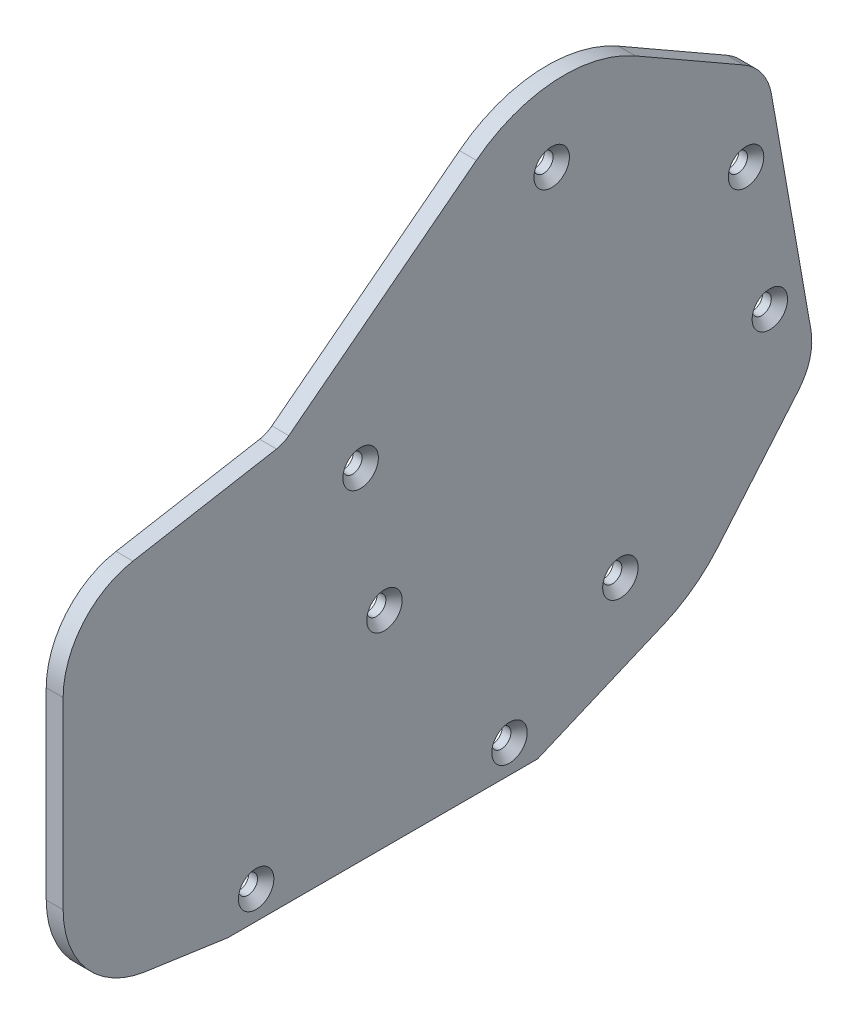
ISO-10303-21;
HEADER;
FILE_DESCRIPTION(('STEP AP214'),'2;1');
FILE_NAME('part.step','',(''),(''),'','','');
FILE_SCHEMA(('AUTOMOTIVE_DESIGN { 1 0 10303 214 1 1 1 1 }'));
ENDSEC;
DATA;
#1=APPLICATION_CONTEXT('core data for automotive mechanical design processes');
#2=APPLICATION_PROTOCOL_DEFINITION('international standard','automotive_design',2000,#1);
#3=PRODUCT_CONTEXT('',#1,'mechanical');
#4=PRODUCT('Part','Part','',(#3));
#5=PRODUCT_RELATED_PRODUCT_CATEGORY('part','',(#4));
#6=PRODUCT_DEFINITION_FORMATION('','',#4);
#7=PRODUCT_DEFINITION_CONTEXT('part definition',#1,'design');
#8=PRODUCT_DEFINITION('design','',#6,#7);
#9=PRODUCT_DEFINITION_SHAPE('','',#8);
#10=(LENGTH_UNIT() NAMED_UNIT(*) SI_UNIT(.MILLI.,.METRE.));
#11=(NAMED_UNIT(*) PLANE_ANGLE_UNIT() SI_UNIT($,.RADIAN.));
#12=(NAMED_UNIT(*) SI_UNIT($,.STERADIAN.) SOLID_ANGLE_UNIT());
#13=UNCERTAINTY_MEASURE_WITH_UNIT(LENGTH_MEASURE(1.E-05),#10,'distance_accuracy_value','');
#14=(GEOMETRIC_REPRESENTATION_CONTEXT(3) GLOBAL_UNCERTAINTY_ASSIGNED_CONTEXT((#13)) GLOBAL_UNIT_ASSIGNED_CONTEXT((#10,
#11,#12)) REPRESENTATION_CONTEXT('',''));
#15=CARTESIAN_POINT('',(0.,0.,0.));
#16=DIRECTION('',(0.,0.,1.));
#17=DIRECTION('',(1.,0.,0.));
#18=AXIS2_PLACEMENT_3D('',#15,#16,#17);
#19=CARTESIAN_POINT('',(32.,107.827207129074,19.0128458712949));
#20=DIRECTION('',(0.,-0.98480775301221,-0.173648177666922));
#21=DIRECTION('',(0.,0.173648177666922,-0.98480775301221));
#22=AXIS2_PLACEMENT_3D('',#19,#20,#21);
#23=PLANE('',#22);
#24=DIRECTION('',(0.,-0.173648177666922,0.98480775301221));
#25=VECTOR('',#24,1.);
#26=CARTESIAN_POINT('',(29.,107.827207129074,19.0128458712949));
#27=LINE('',#26,#25);
#28=CARTESIAN_POINT('',(29.,107.851102741169,18.8773271208524));
#29=VERTEX_POINT('',#28);
#30=CARTESIAN_POINT('',(29.,103.355324829032,44.3741506589923));
#31=VERTEX_POINT('',#30);
#32=EDGE_CURVE('E184',#29,#31,#27,.T.);
#33=ORIENTED_EDGE('',*,*,#32,.T.);
#34=DIRECTION('',(-1.,0.,0.));
#35=VECTOR('',#34,1.);
#36=CARTESIAN_POINT('',(32.,103.355324829032,44.3741506589923));
#37=LINE('',#36,#35);
#38=CARTESIAN_POINT('',(32.,103.355324829032,44.3741506589923));
#39=VERTEX_POINT('',#38);
#40=EDGE_CURVE('E11',#39,#31,#37,.T.);
#41=ORIENTED_EDGE('',*,*,#40,.F.);
#42=DIRECTION('',(0.,-0.173648177666922,0.98480775301221));
#43=VECTOR('',#42,1.);
#44=CARTESIAN_POINT('',(32.,107.827207129074,19.0128458712949));
#45=LINE('',#44,#43);
#46=CARTESIAN_POINT('',(32.,107.851102741169,18.8773271208524));
#47=VERTEX_POINT('',#46);
#48=EDGE_CURVE('E221',#47,#39,#45,.T.);
#49=ORIENTED_EDGE('',*,*,#48,.F.);
#50=DIRECTION('',(-1.,0.,0.));
#51=VECTOR('',#50,1.);
#52=CARTESIAN_POINT('',(32.,107.851102741169,18.8773271208524));
#53=LINE('',#52,#51);
#54=EDGE_CURVE('E180',#47,#29,#53,.T.);
#55=ORIENTED_EDGE('',*,*,#54,.T.);
#56=EDGE_LOOP('',(#33,#41,#49,#55));
#57=FACE_BOUND('',#56,.T.);
#58=ADVANCED_FACE('F41',(#57),#23,.F.);
#59=CARTESIAN_POINT('',(32.,88.5832085338493,41.7694279939884));
#60=DIRECTION('',(-1.,0.,0.));
#61=DIRECTION('',(0.,0.,1.));
#62=AXIS2_PLACEMENT_3D('',#59,#60,#61);
#63=CYLINDRICAL_SURFACE('',#62,15.);
#64=CARTESIAN_POINT('',(29.,88.5832085338493,41.7694279939884));
#65=DIRECTION('',(1.,0.,0.));
#66=DIRECTION('',(0.,0.,-1.));
#67=AXIS2_PLACEMENT_3D('',#64,#65,#66);
#68=CIRCLE('',#67,15.);
#69=CARTESIAN_POINT('',(29.,88.5832085338493,56.7694279939884));
#70=VERTEX_POINT('',#69);
#71=EDGE_CURVE('E187',#31,#70,#68,.T.);
#72=ORIENTED_EDGE('',*,*,#71,.T.);
#73=DIRECTION('',(-1.,0.,0.));
#74=VECTOR('',#73,1.);
#75=CARTESIAN_POINT('',(32.,88.5832085338493,56.7694279939884));
#76=LINE('',#75,#74);
#77=CARTESIAN_POINT('',(32.,88.5832085338493,56.7694279939884));
#78=VERTEX_POINT('',#77);
#79=EDGE_CURVE('E49',#78,#70,#76,.T.);
#80=ORIENTED_EDGE('',*,*,#79,.F.);
#81=CARTESIAN_POINT('',(32.,88.5832085338493,41.7694279939884));
#82=DIRECTION('',(1.,0.,0.));
#83=DIRECTION('',(0.,0.,-1.));
#84=AXIS2_PLACEMENT_3D('',#81,#82,#83);
#85=CIRCLE('',#84,15.);
#86=EDGE_CURVE('E120',#39,#78,#85,.T.);
#87=ORIENTED_EDGE('',*,*,#86,.F.);
#88=ORIENTED_EDGE('',*,*,#40,.T.);
#89=EDGE_LOOP('',(#72,#80,#87,#88));
#90=FACE_BOUND('',#89,.T.);
#91=ADVANCED_FACE('F315',(#90),#63,.T.);
#92=CARTESIAN_POINT('',(32.,0.,56.7694279939884));
#93=DIRECTION('',(0.,0.,-1.));
#94=DIRECTION('',(-1.,0.,0.));
#95=AXIS2_PLACEMENT_3D('',#92,#93,#94);
#96=PLANE('',#95);
#97=DIRECTION('',(0.,-1.,0.));
#98=VECTOR('',#97,1.);
#99=CARTESIAN_POINT('',(29.,0.,56.7694279939884));
#100=LINE('',#99,#98);
#101=CARTESIAN_POINT('',(29.,55.9344976089796,56.7694279939884));
#102=VERTEX_POINT('',#101);
#103=EDGE_CURVE('E190',#70,#102,#100,.T.);
#104=ORIENTED_EDGE('',*,*,#103,.T.);
#105=DIRECTION('',(-1.,0.,0.));
#106=VECTOR('',#105,1.);
#107=CARTESIAN_POINT('',(32.,55.9344976089796,56.7694279939884));
#108=LINE('',#107,#106);
#109=CARTESIAN_POINT('',(32.,55.9344976089796,56.7694279939884));
#110=VERTEX_POINT('',#109);
#111=EDGE_CURVE('E247',#110,#102,#108,.T.);
#112=ORIENTED_EDGE('',*,*,#111,.F.);
#113=DIRECTION('',(0.,-1.,0.));
#114=VECTOR('',#113,1.);
#115=CARTESIAN_POINT('',(32.,0.,56.7694279939884));
#116=LINE('',#115,#114);
#117=EDGE_CURVE('E255',#78,#110,#116,.T.);
#118=ORIENTED_EDGE('',*,*,#117,.F.);
#119=ORIENTED_EDGE('',*,*,#79,.T.);
#120=EDGE_LOOP('',(#104,#112,#118,#119));
#121=FACE_BOUND('',#120,.T.);
#122=ADVANCED_FACE('F253',(#121),#96,.F.);
#123=CARTESIAN_POINT('',(32.,55.9344976089796,39.7694279939874));
#124=DIRECTION('',(-1.,0.,0.));
#125=DIRECTION('',(0.,0.,1.));
#126=AXIS2_PLACEMENT_3D('',#123,#124,#125);
#127=CYLINDRICAL_SURFACE('',#126,17.000000000001);
#128=CARTESIAN_POINT('',(29.,55.9344976089796,39.7694279939874));
#129=DIRECTION('',(1.,0.,0.));
#130=DIRECTION('',(0.,0.,-1.));
#131=AXIS2_PLACEMENT_3D('',#128,#129,#130);
#132=CIRCLE('',#131,17.000000000001);
#133=CARTESIAN_POINT('',(29.,39.1068244967478,42.1838466875668));
#134=VERTEX_POINT('',#133);
#135=EDGE_CURVE('E192',#102,#134,#132,.T.);
#136=ORIENTED_EDGE('',*,*,#135,.T.);
#137=DIRECTION('',(-1.,0.,0.));
#138=VECTOR('',#137,1.);
#139=CARTESIAN_POINT('',(32.,39.1068244967478,42.1838466875668));
#140=LINE('',#139,#138);
#141=CARTESIAN_POINT('',(32.,39.1068244967478,42.1838466875668));
#142=VERTEX_POINT('',#141);
#143=EDGE_CURVE('E245',#142,#134,#140,.T.);
#144=ORIENTED_EDGE('',*,*,#143,.F.);
#145=CARTESIAN_POINT('',(32.,55.9344976089796,39.7694279939874));
#146=DIRECTION('',(1.,0.,0.));
#147=DIRECTION('',(0.,0.,-1.));
#148=AXIS2_PLACEMENT_3D('',#145,#146,#147);
#149=CIRCLE('',#148,17.000000000001);
#150=EDGE_CURVE('E267',#110,#142,#149,.T.);
#151=ORIENTED_EDGE('',*,*,#150,.F.);
#152=ORIENTED_EDGE('',*,*,#111,.T.);
#153=EDGE_LOOP('',(#136,#144,#151,#152));
#154=FACE_BOUND('',#153,.T.);
#155=ADVANCED_FACE('F264',(#154),#127,.T.);
#156=CARTESIAN_POINT('',(32.,32.3875872427274,-4.64694052215296));
#157=DIRECTION('',(0.,-0.98986312424887,0.142024629034072));
#158=DIRECTION('',(0.,-0.142024629034072,-0.98986312424887));
#159=AXIS2_PLACEMENT_3D('',#156,#157,#158);
#160=PLANE('',#159);
#161=DIRECTION('',(0.,0.142024629034072,0.98986312424887));
#162=VECTOR('',#161,1.);
#163=CARTESIAN_POINT('',(29.,32.3875872427274,-4.64694052215296));
#164=LINE('',#163,#162);
#165=CARTESIAN_POINT('',(29.,37.,27.5));
#166=VERTEX_POINT('',#165);
#167=EDGE_CURVE('E195',#166,#134,#164,.T.);
#168=ORIENTED_EDGE('',*,*,#167,.F.);
#169=DIRECTION('',(-1.,0.,0.));
#170=VECTOR('',#169,1.);
#171=CARTESIAN_POINT('',(32.,37.,27.5));
#172=LINE('',#171,#170);
#173=CARTESIAN_POINT('',(32.,37.,27.5));
#174=VERTEX_POINT('',#173);
#175=EDGE_CURVE('E243',#174,#166,#172,.T.);
#176=ORIENTED_EDGE('',*,*,#175,.F.);
#177=DIRECTION('',(0.,0.142024629034072,0.98986312424887));
#178=VECTOR('',#177,1.);
#179=CARTESIAN_POINT('',(32.,32.3875872427274,-4.64694052215296));
#180=LINE('',#179,#178);
#181=EDGE_CURVE('E269',#174,#142,#180,.T.);
#182=ORIENTED_EDGE('',*,*,#181,.T.);
#183=ORIENTED_EDGE('',*,*,#143,.T.);
#184=EDGE_LOOP('',(#168,#176,#182,#183));
#185=FACE_BOUND('',#184,.T.);
#186=ADVANCED_FACE('F326',(#185),#160,.T.);
#187=CARTESIAN_POINT('',(32.,37.,0.));
#188=DIRECTION('',(0.,1.,0.));
#189=DIRECTION('',(0.,0.,1.));
#190=AXIS2_PLACEMENT_3D('',#187,#188,#189);
#191=PLANE('',#190);
#192=DIRECTION('',(0.,0.,-1.));
#193=VECTOR('',#192,1.);
#194=CARTESIAN_POINT('',(29.,37.,0.));
#195=LINE('',#194,#193);
#196=CARTESIAN_POINT('',(29.,37.,-27.5));
#197=VERTEX_POINT('',#196);
#198=EDGE_CURVE('E198',#166,#197,#195,.T.);
#199=ORIENTED_EDGE('',*,*,#198,.T.);
#200=DIRECTION('',(-1.,0.,0.));
#201=VECTOR('',#200,1.);
#202=CARTESIAN_POINT('',(32.,37.,-27.5));
#203=LINE('',#202,#201);
#204=CARTESIAN_POINT('',(32.,37.,-27.5));
#205=VERTEX_POINT('',#204);
#206=EDGE_CURVE('E240',#205,#197,#203,.T.);
#207=ORIENTED_EDGE('',*,*,#206,.F.);
#208=DIRECTION('',(0.,0.,-1.));
#209=VECTOR('',#208,1.);
#210=CARTESIAN_POINT('',(32.,37.,0.));
#211=LINE('',#210,#209);
#212=EDGE_CURVE('E271',#174,#205,#211,.T.);
#213=ORIENTED_EDGE('',*,*,#212,.F.);
#214=ORIENTED_EDGE('',*,*,#175,.T.);
#215=EDGE_LOOP('',(#199,#207,#213,#214));
#216=FACE_BOUND('',#215,.T.);
#217=ADVANCED_FACE('F329',(#216),#191,.F.);
#218=CARTESIAN_POINT('',(32.,21.4742724506043,9.10751962461317));
#219=DIRECTION('',(0.,0.920624591801857,0.390448922356899));
#220=DIRECTION('',(0.,-0.390448922356899,0.920624591801857));
#221=AXIS2_PLACEMENT_3D('',#218,#219,#220);
#222=PLANE('',#221);
#223=DIRECTION('',(0.,0.390448922356899,-0.920624591801857));
#224=VECTOR('',#223,1.);
#225=CARTESIAN_POINT('',(29.,21.4742724506043,9.10751962461317));
#226=LINE('',#225,#224);
#227=CARTESIAN_POINT('',(29.,46.5240729090526,-49.956447520101));
#228=VERTEX_POINT('',#227);
#229=EDGE_CURVE('E200',#197,#228,#226,.T.);
#230=ORIENTED_EDGE('',*,*,#229,.T.);
#231=DIRECTION('',(-1.,0.,0.));
#232=VECTOR('',#231,1.);
#233=CARTESIAN_POINT('',(32.,46.5240729090526,-49.956447520101));
#234=LINE('',#233,#232);
#235=CARTESIAN_POINT('',(32.,46.5240729090526,-49.956447520101));
#236=VERTEX_POINT('',#235);
#237=EDGE_CURVE('E237',#236,#228,#234,.T.);
#238=ORIENTED_EDGE('',*,*,#237,.F.);
#239=DIRECTION('',(0.,0.390448922356899,-0.920624591801857));
#240=VECTOR('',#239,1.);
#241=CARTESIAN_POINT('',(32.,21.4742724506043,9.10751962461317));
#242=LINE('',#241,#240);
#243=EDGE_CURVE('E277',#205,#236,#242,.T.);
#244=ORIENTED_EDGE('',*,*,#243,.F.);
#245=ORIENTED_EDGE('',*,*,#206,.T.);
#246=EDGE_LOOP('',(#230,#238,#244,#245));
#247=FACE_BOUND('',#246,.T.);
#248=ADVANCED_FACE('F333',(#247),#222,.F.);
#249=CARTESIAN_POINT('',(32.,70.,-40.));
#250=DIRECTION('',(-1.,0.,0.));
#251=DIRECTION('',(0.,0.,1.));
#252=AXIS2_PLACEMENT_3D('',#249,#250,#251);
#253=CYLINDRICAL_SURFACE('',#252,25.5);
#254=CARTESIAN_POINT('',(29.,70.,-40.));
#255=DIRECTION('',(1.,0.,0.));
#256=DIRECTION('',(0.,0.,-1.));
#257=AXIS2_PLACEMENT_3D('',#254,#255,#256);
#258=CIRCLE('',#257,25.5);
#259=CARTESIAN_POINT('',(29.,53.5392235158278,-59.4754419086737));
#260=VERTEX_POINT('',#259);
#261=EDGE_CURVE('E202',#228,#260,#258,.T.);
#262=ORIENTED_EDGE('',*,*,#261,.T.);
#263=DIRECTION('',(-1.,0.,0.));
#264=VECTOR('',#263,1.);
#265=CARTESIAN_POINT('',(32.,53.5392235158278,-59.4754419086737));
#266=LINE('',#265,#264);
#267=CARTESIAN_POINT('',(32.,53.5392235158278,-59.4754419086737));
#268=VERTEX_POINT('',#267);
#269=EDGE_CURVE('E234',#268,#260,#266,.T.);
#270=ORIENTED_EDGE('',*,*,#269,.F.);
#271=CARTESIAN_POINT('',(32.,70.,-40.));
#272=DIRECTION('',(1.,0.,0.));
#273=DIRECTION('',(0.,0.,-1.));
#274=AXIS2_PLACEMENT_3D('',#271,#272,#273);
#275=CIRCLE('',#274,25.5);
#276=EDGE_CURVE('E279',#236,#268,#275,.T.);
#277=ORIENTED_EDGE('',*,*,#276,.F.);
#278=ORIENTED_EDGE('',*,*,#237,.T.);
#279=EDGE_LOOP('',(#262,#270,#277,#278));
#280=FACE_BOUND('',#279,.T.);
#281=ADVANCED_FACE('F337',(#280),#253,.T.);
#282=CARTESIAN_POINT('',(32.,-7.01246348953157,-8.29674259038667));
#283=DIRECTION('',(0.,0.645520646438126,0.763742819947987));
#284=DIRECTION('',(0.,-0.763742819947987,0.645520646438126));
#285=AXIS2_PLACEMENT_3D('',#282,#283,#284);
#286=PLANE('',#285);
#287=DIRECTION('',(0.,0.763742819947987,-0.645520646438126));
#288=VECTOR('',#287,1.);
#289=CARTESIAN_POINT('',(29.,-7.01246348953157,-8.29674259038667));
#290=LINE('',#289,#288);
#291=CARTESIAN_POINT('',(29.,70.5163970676817,-73.8246649188899));
#292=VERTEX_POINT('',#291);
#293=EDGE_CURVE('E204',#260,#292,#290,.T.);
#294=ORIENTED_EDGE('',*,*,#293,.T.);
#295=DIRECTION('',(-1.,0.,0.));
#296=VECTOR('',#295,1.);
#297=CARTESIAN_POINT('',(32.,70.5163970676817,-73.8246649188899));
#298=LINE('',#297,#296);
#299=CARTESIAN_POINT('',(32.,70.5163970676817,-73.8246649188899));
#300=VERTEX_POINT('',#299);
#301=EDGE_CURVE('E232',#300,#292,#298,.T.);
#302=ORIENTED_EDGE('',*,*,#301,.F.);
#303=DIRECTION('',(0.,0.763742819947987,-0.645520646438126));
#304=VECTOR('',#303,1.);
#305=CARTESIAN_POINT('',(32.,-7.01246348953157,-8.29674259038667));
#306=LINE('',#305,#304);
#307=EDGE_CURVE('E281',#268,#300,#306,.T.);
#308=ORIENTED_EDGE('',*,*,#307,.F.);
#309=ORIENTED_EDGE('',*,*,#269,.T.);
#310=EDGE_LOOP('',(#294,#302,#308,#309));
#311=FACE_BOUND('',#310,.T.);
#312=ADVANCED_FACE('F341',(#311),#286,.F.);
#313=CARTESIAN_POINT('',(32.,76.971603532063,-66.18723671941));
#314=DIRECTION('',(-1.,0.,0.));
#315=DIRECTION('',(0.,0.,1.));
#316=AXIS2_PLACEMENT_3D('',#313,#314,#315);
#317=CYLINDRICAL_SURFACE('',#316,10.);
#318=CARTESIAN_POINT('',(29.,76.971603532063,-66.18723671941));
#319=DIRECTION('',(1.,0.,0.));
#320=DIRECTION('',(0.,0.,-1.));
#321=AXIS2_PLACEMENT_3D('',#318,#319,#320);
#322=CIRCLE('',#321,10.);
#323=CARTESIAN_POINT('',(29.,78.7080853087322,-76.0353142495321));
#324=VERTEX_POINT('',#323);
#325=EDGE_CURVE('E207',#324,#292,#322,.F.);
#326=ORIENTED_EDGE('',*,*,#325,.F.);
#327=DIRECTION('',(-1.,0.,0.));
#328=VECTOR('',#327,1.);
#329=CARTESIAN_POINT('',(32.,78.7080853087322,-76.0353142495321));
#330=LINE('',#329,#328);
#331=CARTESIAN_POINT('',(32.,78.7080853087322,-76.0353142495321));
#332=VERTEX_POINT('',#331);
#333=EDGE_CURVE('E230',#332,#324,#330,.T.);
#334=ORIENTED_EDGE('',*,*,#333,.F.);
#335=CARTESIAN_POINT('',(32.,76.971603532063,-66.18723671941));
#336=DIRECTION('',(1.,0.,0.));
#337=DIRECTION('',(0.,0.,-1.));
#338=AXIS2_PLACEMENT_3D('',#335,#336,#337);
#339=CIRCLE('',#338,10.);
#340=EDGE_CURVE('E283',#332,#300,#339,.F.);
#341=ORIENTED_EDGE('',*,*,#340,.T.);
#342=ORIENTED_EDGE('',*,*,#301,.T.);
#343=EDGE_LOOP('',(#326,#334,#341,#342));
#344=FACE_BOUND('',#343,.T.);
#345=ADVANCED_FACE('F345',(#344),#317,.T.);
#346=CARTESIAN_POINT('',(32.,15.3761437126822,-87.2024442935679));
#347=DIRECTION('',(0.,0.173648177666922,-0.984807753012209));
#348=DIRECTION('',(0.,0.98480775301221,0.173648177666922));
#349=AXIS2_PLACEMENT_3D('',#346,#347,#348);
#350=PLANE('',#349);
#351=DIRECTION('',(0.,-0.98480775301221,-0.173648177666922));
#352=VECTOR('',#351,1.);
#353=CARTESIAN_POINT('',(29.,15.3761437126822,-87.2024442935679));
#354=LINE('',#353,#352);
#355=CARTESIAN_POINT('',(29.,118.45822872417,-69.0262914783599));
#356=VERTEX_POINT('',#355);
#357=EDGE_CURVE('E210',#356,#324,#354,.T.);
#358=ORIENTED_EDGE('',*,*,#357,.F.);
#359=DIRECTION('',(-1.,0.,0.));
#360=VECTOR('',#359,1.);
#361=CARTESIAN_POINT('',(32.,118.45822872417,-69.0262914783599));
#362=LINE('',#361,#360);
#363=CARTESIAN_POINT('',(32.,118.45822872417,-69.0262914783599));
#364=VERTEX_POINT('',#363);
#365=EDGE_CURVE('E228',#364,#356,#362,.T.);
#366=ORIENTED_EDGE('',*,*,#365,.F.);
#367=DIRECTION('',(0.,-0.98480775301221,-0.173648177666922));
#368=VECTOR('',#367,1.);
#369=CARTESIAN_POINT('',(32.,15.3761437126822,-87.2024442935679));
#370=LINE('',#369,#368);
#371=EDGE_CURVE('E286',#364,#332,#370,.T.);
#372=ORIENTED_EDGE('',*,*,#371,.T.);
#373=ORIENTED_EDGE('',*,*,#333,.T.);
#374=EDGE_LOOP('',(#358,#366,#372,#373));
#375=FACE_BOUND('',#374,.T.);
#376=ADVANCED_FACE('F349',(#375),#350,.T.);
#377=CARTESIAN_POINT('',(32.,116.7217469475,-59.1782139482378));
#378=DIRECTION('',(-1.,0.,0.));
#379=DIRECTION('',(0.,0.,1.));
#380=AXIS2_PLACEMENT_3D('',#377,#378,#379);
#381=CYLINDRICAL_SURFACE('',#380,9.99999999999999);
#382=CARTESIAN_POINT('',(29.,116.7217469475,-59.1782139482378));
#383=DIRECTION('',(1.,0.,0.));
#384=DIRECTION('',(0.,0.,-1.));
#385=AXIS2_PLACEMENT_3D('',#382,#383,#384);
#386=CIRCLE('',#385,9.99999999999999);
#387=CARTESIAN_POINT('',(29.,125.399811115155,-64.1472382289268));
#388=VERTEX_POINT('',#387);
#389=EDGE_CURVE('E213',#356,#388,#386,.T.);
#390=ORIENTED_EDGE('',*,*,#389,.T.);
#391=DIRECTION('',(-1.,0.,0.));
#392=VECTOR('',#391,1.);
#393=CARTESIAN_POINT('',(32.,125.399811115155,-64.1472382289268));
#394=LINE('',#393,#392);
#395=CARTESIAN_POINT('',(32.,125.399811115155,-64.1472382289268));
#396=VERTEX_POINT('',#395);
#397=EDGE_CURVE('E225',#396,#388,#394,.T.);
#398=ORIENTED_EDGE('',*,*,#397,.F.);
#399=CARTESIAN_POINT('',(32.,116.7217469475,-59.1782139482378));
#400=DIRECTION('',(1.,0.,0.));
#401=DIRECTION('',(0.,0.,-1.));
#402=AXIS2_PLACEMENT_3D('',#399,#400,#401);
#403=CIRCLE('',#402,9.99999999999999);
#404=EDGE_CURVE('E289',#364,#396,#403,.T.);
#405=ORIENTED_EDGE('',*,*,#404,.F.);
#406=ORIENTED_EDGE('',*,*,#365,.T.);
#407=EDGE_LOOP('',(#390,#398,#405,#406));
#408=FACE_BOUND('',#407,.T.);
#409=ADVANCED_FACE('F295',(#408),#381,.T.);
#410=CARTESIAN_POINT('',(32.,122.098348813603,-69.9130184065967));
#411=DIRECTION('',(0.,-0.867806416765414,0.496902428068903));
#412=DIRECTION('',(0.,-0.496902428068904,-0.867806416765415));
#413=AXIS2_PLACEMENT_3D('',#410,#411,#412);
#414=PLANE('',#413);
#415=DIRECTION('',(0.,0.496902428068904,0.867806416765415));
#416=VECTOR('',#415,1.);
#417=CARTESIAN_POINT('',(29.,122.098348813603,-69.9130184065967));
#418=LINE('',#417,#416);
#419=CARTESIAN_POINT('',(29.,136.445412513067,-44.8568439207455));
#420=VERTEX_POINT('',#419);
#421=EDGE_CURVE('E215',#388,#420,#418,.T.);
#422=ORIENTED_EDGE('',*,*,#421,.T.);
#423=DIRECTION('',(-1.,0.,0.));
#424=VECTOR('',#423,1.);
#425=CARTESIAN_POINT('',(32.,136.445412513067,-44.8568439207455));
#426=LINE('',#425,#424);
#427=CARTESIAN_POINT('',(32.,136.445412513067,-44.8568439207455));
#428=VERTEX_POINT('',#427);
#429=EDGE_CURVE('E176',#428,#420,#426,.T.);
#430=ORIENTED_EDGE('',*,*,#429,.F.);
#431=DIRECTION('',(0.,0.496902428068904,0.867806416765415));
#432=VECTOR('',#431,1.);
#433=CARTESIAN_POINT('',(32.,122.098348813603,-69.9130184065967));
#434=LINE('',#433,#432);
#435=EDGE_CURVE('E163',#396,#428,#434,.T.);
#436=ORIENTED_EDGE('',*,*,#435,.F.);
#437=ORIENTED_EDGE('',*,*,#397,.T.);
#438=EDGE_LOOP('',(#422,#430,#436,#437));
#439=FACE_BOUND('',#438,.T.);
#440=ADVANCED_FACE('F299',(#439),#414,.F.);
#441=CARTESIAN_POINT('',(32.,114.316348885549,-32.1858320049885));
#442=DIRECTION('',(-1.,0.,0.));
#443=DIRECTION('',(0.,0.,1.));
#444=AXIS2_PLACEMENT_3D('',#441,#442,#443);
#445=CYLINDRICAL_SURFACE('',#444,25.5);
#446=CARTESIAN_POINT('',(29.,114.316348885549,-32.1858320049885));
#447=DIRECTION('',(1.,0.,0.));
#448=DIRECTION('',(0.,0.,-1.));
#449=AXIS2_PLACEMENT_3D('',#446,#447,#448);
#450=CIRCLE('',#449,25.5);
#451=CARTESIAN_POINT('',(29.,134.506640074601,-16.6101412754802));
#452=VERTEX_POINT('',#451);
#453=EDGE_CURVE('E172',#420,#452,#450,.T.);
#454=ORIENTED_EDGE('',*,*,#453,.T.);
#455=DIRECTION('',(-1.,0.,0.));
#456=VECTOR('',#455,1.);
#457=CARTESIAN_POINT('',(32.,134.506640074601,-16.6101412754802));
#458=LINE('',#457,#456);
#459=CARTESIAN_POINT('',(32.,134.506640074601,-16.6101412754802));
#460=VERTEX_POINT('',#459);
#461=EDGE_CURVE('E169',#460,#452,#458,.T.);
#462=ORIENTED_EDGE('',*,*,#461,.F.);
#463=CARTESIAN_POINT('',(32.,114.316348885549,-32.1858320049885));
#464=DIRECTION('',(1.,0.,0.));
#465=DIRECTION('',(0.,0.,-1.));
#466=AXIS2_PLACEMENT_3D('',#463,#464,#465);
#467=CIRCLE('',#466,25.5);
#468=EDGE_CURVE('E157',#428,#460,#467,.T.);
#469=ORIENTED_EDGE('',*,*,#468,.F.);
#470=ORIENTED_EDGE('',*,*,#429,.T.);
#471=EDGE_LOOP('',(#454,#462,#469,#470));
#472=FACE_BOUND('',#471,.T.);
#473=ADVANCED_FACE('F170',(#472),#445,.T.);
#474=CARTESIAN_POINT('',(32.,76.2903870949506,58.8538057177573));
#475=DIRECTION('',(0.,0.791776125060864,0.610811401157185));
#476=DIRECTION('',(0.,-0.610811401157185,0.791776125060864));
#477=AXIS2_PLACEMENT_3D('',#474,#475,#476);
#478=PLANE('',#477);
#479=DIRECTION('',(0.,0.610811401157185,-0.791776125060864));
#480=VECTOR('',#479,1.);
#481=CARTESIAN_POINT('',(29.,76.2903870949506,58.8538057177573));
#482=LINE('',#481,#480);
#483=CARTESIAN_POINT('',(29.,108.816260880926,16.6915110034011));
#484=VERTEX_POINT('',#483);
#485=EDGE_CURVE('E218',#484,#452,#482,.T.);
#486=ORIENTED_EDGE('',*,*,#485,.F.);
#487=DIRECTION('',(-1.,0.,0.));
#488=VECTOR('',#487,1.);
#489=CARTESIAN_POINT('',(32.,108.816260880926,16.6915110034011));
#490=LINE('',#489,#488);
#491=CARTESIAN_POINT('',(32.,108.816260880926,16.6915110034011));
#492=VERTEX_POINT('',#491);
#493=EDGE_CURVE('E109',#492,#484,#490,.T.);
#494=ORIENTED_EDGE('',*,*,#493,.F.);
#495=DIRECTION('',(0.,0.610811401157185,-0.791776125060864));
#496=VECTOR('',#495,1.);
#497=CARTESIAN_POINT('',(32.,76.2903870949506,58.8538057177573));
#498=LINE('',#497,#496);
#499=EDGE_CURVE('E161',#492,#460,#498,.T.);
#500=ORIENTED_EDGE('',*,*,#499,.T.);
#501=ORIENTED_EDGE('',*,*,#461,.T.);
#502=EDGE_LOOP('',(#486,#494,#500,#501));
#503=FACE_BOUND('',#502,.T.);
#504=ADVANCED_FACE('F178',(#503),#478,.T.);
#505=CARTESIAN_POINT('',(32.,112.77514150623,19.745568009187));
#506=DIRECTION('',(-1.,0.,0.));
#507=DIRECTION('',(0.,0.,1.));
#508=AXIS2_PLACEMENT_3D('',#505,#506,#507);
#509=CYLINDRICAL_SURFACE('',#508,5.00000000000001);
#510=CARTESIAN_POINT('',(29.,112.77514150623,19.745568009187));
#511=DIRECTION('',(1.,0.,0.));
#512=DIRECTION('',(0.,0.,-1.));
#513=AXIS2_PLACEMENT_3D('',#510,#511,#512);
#514=CIRCLE('',#513,5.00000000000001);
#515=EDGE_CURVE('E112',#484,#29,#514,.F.);
#516=ORIENTED_EDGE('',*,*,#515,.T.);
#517=ORIENTED_EDGE('',*,*,#54,.F.);
#518=CARTESIAN_POINT('',(32.,112.77514150623,19.745568009187));
#519=DIRECTION('',(1.,0.,0.));
#520=DIRECTION('',(0.,0.,-1.));
#521=AXIS2_PLACEMENT_3D('',#518,#519,#520);
#522=CIRCLE('',#521,5.00000000000001);
#523=EDGE_CURVE('E57',#492,#47,#522,.F.);
#524=ORIENTED_EDGE('',*,*,#523,.F.);
#525=ORIENTED_EDGE('',*,*,#493,.T.);
#526=EDGE_LOOP('',(#516,#517,#524,#525));
#527=FACE_BOUND('',#526,.T.);
#528=ADVANCED_FACE('F303',(#527),#509,.F.);
#529=CARTESIAN_POINT('',(32.,0.,0.));
#530=DIRECTION('',(1.,0.,0.));
#531=DIRECTION('',(0.,0.,-1.));
#532=AXIS2_PLACEMENT_3D('',#529,#530,#531);
#533=PLANE('',#532);
#534=CARTESIAN_POINT('',(32.,109.53787763407,-64.506630381622));
#535=DIRECTION('',(1.,0.,0.));
#536=DIRECTION('',(0.,0.,-1.));
#537=AXIS2_PLACEMENT_3D('',#534,#535,#536);
#538=CIRCLE('',#537,3.15);
#539=CARTESIAN_POINT('',(32.,109.53787763407,-67.6566303816221));
#540=VERTEX_POINT('',#539);
#541=EDGE_CURVE('E697',#540,#540,#538,.T.);
#542=ORIENTED_EDGE('',*,*,#541,.F.);
#543=EDGE_LOOP('',(#542));
#544=FACE_BOUND('',#543,.T.);
#545=CARTESIAN_POINT('',(32.,85.5446582668281,-68.7372823101235));
#546=DIRECTION('',(1.,0.,0.));
#547=DIRECTION('',(0.,0.,-1.));
#548=AXIS2_PLACEMENT_3D('',#545,#546,#547);
#549=CIRCLE('',#548,3.15);
#550=CARTESIAN_POINT('',(32.,85.5446582668281,-71.8872823101235));
#551=VERTEX_POINT('',#550);
#552=EDGE_CURVE('E704',#551,#551,#549,.T.);
#553=ORIENTED_EDGE('',*,*,#552,.F.);
#554=EDGE_LOOP('',(#553));
#555=FACE_BOUND('',#554,.T.);
#556=CARTESIAN_POINT('',(32.,97.469329286219,3.93750845272652));
#557=DIRECTION('',(1.,0.,0.));
#558=DIRECTION('',(0.,0.,-1.));
#559=AXIS2_PLACEMENT_3D('',#556,#557,#558);
#560=CIRCLE('',#559,3.15);
#561=CARTESIAN_POINT('',(32.,97.469329286219,0.787508452726517));
#562=VERTEX_POINT('',#561);
#563=EDGE_CURVE('E713',#562,#562,#560,.T.);
#564=ORIENTED_EDGE('',*,*,#563,.F.);
#565=EDGE_LOOP('',(#564));
#566=FACE_BOUND('',#565,.T.);
#567=CARTESIAN_POINT('',(32.,73.476109918977,-0.293143475774924));
#568=DIRECTION('',(1.,0.,0.));
#569=DIRECTION('',(0.,0.,-1.));
#570=AXIS2_PLACEMENT_3D('',#567,#568,#569);
#571=CIRCLE('',#570,3.15);
#572=CARTESIAN_POINT('',(32.,73.476109918977,-3.44314347577492));
#573=VERTEX_POINT('',#572);
#574=EDGE_CURVE('E722',#573,#573,#571,.T.);
#575=ORIENTED_EDGE('',*,*,#574,.F.);
#576=EDGE_LOOP('',(#575));
#577=FACE_BOUND('',#576,.T.);
#578=CARTESIAN_POINT('',(32.,57.5421819243955,-42.1966494474866));
#579=DIRECTION('',(1.,0.,0.));
#580=DIRECTION('',(0.,0.,-1.));
#581=AXIS2_PLACEMENT_3D('',#578,#579,#580);
#582=CIRCLE('',#581,3.15);
#583=CARTESIAN_POINT('',(32.,57.5421819243955,-45.3466494474866));
#584=VERTEX_POINT('',#583);
#585=EDGE_CURVE('E731',#584,#584,#582,.T.);
#586=ORIENTED_EDGE('',*,*,#585,.F.);
#587=EDGE_LOOP('',(#586));
#588=FACE_BOUND('',#587,.T.);
#589=CARTESIAN_POINT('',(32.,126.774166961154,-29.9891825575019));
#590=DIRECTION('',(1.,0.,0.));
#591=DIRECTION('',(0.,0.,-1.));
#592=AXIS2_PLACEMENT_3D('',#589,#590,#591);
#593=CIRCLE('',#592,3.14999999999999);
#594=CARTESIAN_POINT('',(32.,126.774166961154,-33.1391825575019));
#595=VERTEX_POINT('',#594);
#596=EDGE_CURVE('E740',#595,#595,#593,.T.);
#597=ORIENTED_EDGE('',*,*,#596,.F.);
#598=EDGE_LOOP('',(#597));
#599=FACE_BOUND('',#598,.T.);
#600=CARTESIAN_POINT('',(32.,42.,22.5));
#601=DIRECTION('',(1.,0.,0.));
#602=DIRECTION('',(0.,0.,-1.));
#603=AXIS2_PLACEMENT_3D('',#600,#601,#602);
#604=CIRCLE('',#603,3.15);
#605=CARTESIAN_POINT('',(32.,42.,19.35));
#606=VERTEX_POINT('',#605);
#607=EDGE_CURVE('E749',#606,#606,#604,.T.);
#608=ORIENTED_EDGE('',*,*,#607,.F.);
#609=EDGE_LOOP('',(#608));
#610=FACE_BOUND('',#609,.T.);
#611=CARTESIAN_POINT('',(32.,42.,-22.5));
#612=DIRECTION('',(1.,0.,0.));
#613=DIRECTION('',(0.,0.,-1.));
#614=AXIS2_PLACEMENT_3D('',#611,#612,#613);
#615=CIRCLE('',#614,3.15);
#616=CARTESIAN_POINT('',(32.,42.,-25.65));
#617=VERTEX_POINT('',#616);
#618=EDGE_CURVE('E758',#617,#617,#615,.T.);
#619=ORIENTED_EDGE('',*,*,#618,.F.);
#620=EDGE_LOOP('',(#619));
#621=FACE_BOUND('',#620,.T.);
#622=ORIENTED_EDGE('',*,*,#48,.T.);
#623=ORIENTED_EDGE('',*,*,#86,.T.);
#624=ORIENTED_EDGE('',*,*,#117,.T.);
#625=ORIENTED_EDGE('',*,*,#150,.T.);
#626=ORIENTED_EDGE('',*,*,#181,.F.);
#627=ORIENTED_EDGE('',*,*,#212,.T.);
#628=ORIENTED_EDGE('',*,*,#243,.T.);
#629=ORIENTED_EDGE('',*,*,#276,.T.);
#630=ORIENTED_EDGE('',*,*,#307,.T.);
#631=ORIENTED_EDGE('',*,*,#340,.F.);
#632=ORIENTED_EDGE('',*,*,#371,.F.);
#633=ORIENTED_EDGE('',*,*,#404,.T.);
#634=ORIENTED_EDGE('',*,*,#435,.T.);
#635=ORIENTED_EDGE('',*,*,#468,.T.);
#636=ORIENTED_EDGE('',*,*,#499,.F.);
#637=ORIENTED_EDGE('',*,*,#523,.T.);
#638=EDGE_LOOP('',(#622,#623,#624,#625,#626,#627,#628,#629,#630,#631,#632,#633,#634,#635,#636,#637));
#639=FACE_BOUND('',#638,.T.);
#640=ADVANCED_FACE('F159',(#544,#555,#566,#577,#588,#599,#610,#621,#639),#533,.T.);
#641=CARTESIAN_POINT('',(29.,0.,0.));
#642=DIRECTION('',(1.,0.,0.));
#643=DIRECTION('',(0.,0.,-1.));
#644=AXIS2_PLACEMENT_3D('',#641,#642,#643);
#645=PLANE('',#644);
#646=CARTESIAN_POINT('',(29.,109.53787763407,-64.506630381622));
#647=DIRECTION('',(1.,0.,0.));
#648=DIRECTION('',(0.,0.,-1.));
#649=AXIS2_PLACEMENT_3D('',#646,#647,#648);
#650=CIRCLE('',#649,1.69999999999999);
#651=CARTESIAN_POINT('',(29.,109.53787763407,-66.206630381622));
#652=VERTEX_POINT('',#651);
#653=EDGE_CURVE('E699',#652,#652,#650,.T.);
#654=ORIENTED_EDGE('',*,*,#653,.T.);
#655=EDGE_LOOP('',(#654));
#656=FACE_BOUND('',#655,.T.);
#657=CARTESIAN_POINT('',(29.,85.5446582668281,-68.7372823101235));
#658=DIRECTION('',(1.,0.,0.));
#659=DIRECTION('',(0.,0.,-1.));
#660=AXIS2_PLACEMENT_3D('',#657,#658,#659);
#661=CIRCLE('',#660,1.69999999999999);
#662=CARTESIAN_POINT('',(29.,85.5446582668281,-70.4372823101235));
#663=VERTEX_POINT('',#662);
#664=EDGE_CURVE('E710',#663,#663,#661,.T.);
#665=ORIENTED_EDGE('',*,*,#664,.T.);
#666=EDGE_LOOP('',(#665));
#667=FACE_BOUND('',#666,.T.);
#668=CARTESIAN_POINT('',(29.,97.469329286219,3.93750845272652));
#669=DIRECTION('',(1.,0.,0.));
#670=DIRECTION('',(0.,0.,-1.));
#671=AXIS2_PLACEMENT_3D('',#668,#669,#670);
#672=CIRCLE('',#671,1.69999999999999);
#673=CARTESIAN_POINT('',(29.,97.469329286219,2.23750845272652));
#674=VERTEX_POINT('',#673);
#675=EDGE_CURVE('E719',#674,#674,#672,.T.);
#676=ORIENTED_EDGE('',*,*,#675,.T.);
#677=EDGE_LOOP('',(#676));
#678=FACE_BOUND('',#677,.T.);
#679=CARTESIAN_POINT('',(29.,73.476109918977,-0.293143475774924));
#680=DIRECTION('',(1.,0.,0.));
#681=DIRECTION('',(0.,0.,-1.));
#682=AXIS2_PLACEMENT_3D('',#679,#680,#681);
#683=CIRCLE('',#682,1.69999999999999);
#684=CARTESIAN_POINT('',(29.,73.476109918977,-1.99314347577492));
#685=VERTEX_POINT('',#684);
#686=EDGE_CURVE('E728',#685,#685,#683,.T.);
#687=ORIENTED_EDGE('',*,*,#686,.T.);
#688=EDGE_LOOP('',(#687));
#689=FACE_BOUND('',#688,.T.);
#690=CARTESIAN_POINT('',(29.,57.5421819243955,-42.1966494474866));
#691=DIRECTION('',(1.,0.,0.));
#692=DIRECTION('',(0.,0.,-1.));
#693=AXIS2_PLACEMENT_3D('',#690,#691,#692);
#694=CIRCLE('',#693,1.69999999999999);
#695=CARTESIAN_POINT('',(29.,57.5421819243955,-43.8966494474866));
#696=VERTEX_POINT('',#695);
#697=EDGE_CURVE('E737',#696,#696,#694,.T.);
#698=ORIENTED_EDGE('',*,*,#697,.T.);
#699=EDGE_LOOP('',(#698));
#700=FACE_BOUND('',#699,.T.);
#701=CARTESIAN_POINT('',(29.,126.774166961154,-29.9891825575019));
#702=DIRECTION('',(1.,0.,0.));
#703=DIRECTION('',(0.,0.,-1.));
#704=AXIS2_PLACEMENT_3D('',#701,#702,#703);
#705=CIRCLE('',#704,1.69999999999998);
#706=CARTESIAN_POINT('',(29.,126.774166961154,-31.6891825575019));
#707=VERTEX_POINT('',#706);
#708=EDGE_CURVE('E746',#707,#707,#705,.T.);
#709=ORIENTED_EDGE('',*,*,#708,.T.);
#710=EDGE_LOOP('',(#709));
#711=FACE_BOUND('',#710,.T.);
#712=CARTESIAN_POINT('',(29.,42.,22.5));
#713=DIRECTION('',(1.,0.,0.));
#714=DIRECTION('',(0.,0.,-1.));
#715=AXIS2_PLACEMENT_3D('',#712,#713,#714);
#716=CIRCLE('',#715,1.69999999999999);
#717=CARTESIAN_POINT('',(29.,42.,20.8));
#718=VERTEX_POINT('',#717);
#719=EDGE_CURVE('E755',#718,#718,#716,.T.);
#720=ORIENTED_EDGE('',*,*,#719,.T.);
#721=EDGE_LOOP('',(#720));
#722=FACE_BOUND('',#721,.T.);
#723=CARTESIAN_POINT('',(29.,42.,-22.5));
#724=DIRECTION('',(1.,0.,0.));
#725=DIRECTION('',(0.,0.,-1.));
#726=AXIS2_PLACEMENT_3D('',#723,#724,#725);
#727=CIRCLE('',#726,1.69999999999999);
#728=CARTESIAN_POINT('',(29.,42.,-24.2));
#729=VERTEX_POINT('',#728);
#730=EDGE_CURVE('E188',#729,#729,#727,.T.);
#731=ORIENTED_EDGE('',*,*,#730,.T.);
#732=EDGE_LOOP('',(#731));
#733=FACE_BOUND('',#732,.T.);
#734=ORIENTED_EDGE('',*,*,#32,.F.);
#735=ORIENTED_EDGE('',*,*,#515,.F.);
#736=ORIENTED_EDGE('',*,*,#485,.T.);
#737=ORIENTED_EDGE('',*,*,#453,.F.);
#738=ORIENTED_EDGE('',*,*,#421,.F.);
#739=ORIENTED_EDGE('',*,*,#389,.F.);
#740=ORIENTED_EDGE('',*,*,#357,.T.);
#741=ORIENTED_EDGE('',*,*,#325,.T.);
#742=ORIENTED_EDGE('',*,*,#293,.F.);
#743=ORIENTED_EDGE('',*,*,#261,.F.);
#744=ORIENTED_EDGE('',*,*,#229,.F.);
#745=ORIENTED_EDGE('',*,*,#198,.F.);
#746=ORIENTED_EDGE('',*,*,#167,.T.);
#747=ORIENTED_EDGE('',*,*,#135,.F.);
#748=ORIENTED_EDGE('',*,*,#103,.F.);
#749=ORIENTED_EDGE('',*,*,#71,.F.);
#750=EDGE_LOOP('',(#734,#735,#736,#737,#738,#739,#740,#741,#742,#743,#744,#745,#746,#747,#748,#749));
#751=FACE_BOUND('',#750,.T.);
#752=ADVANCED_FACE('F259',(#656,#667,#678,#689,#700,#711,#722,#733,#751),#645,.F.);
#753=CARTESIAN_POINT('',(32.,42.,-22.5));
#754=DIRECTION('',(1.,0.,0.));
#755=DIRECTION('',(0.,0.,-1.));
#756=AXIS2_PLACEMENT_3D('',#753,#754,#755);
#757=CYLINDRICAL_SURFACE('',#756,1.69999999999999);
#758=ORIENTED_EDGE('',*,*,#730,.F.);
#759=EDGE_LOOP('',(#758));
#760=FACE_BOUND('',#759,.T.);
#761=CARTESIAN_POINT('',(30.55,42.,-22.5));
#762=DIRECTION('',(1.,0.,0.));
#763=DIRECTION('',(0.,0.,-1.));
#764=AXIS2_PLACEMENT_3D('',#761,#762,#763);
#765=CIRCLE('',#764,1.7);
#766=CARTESIAN_POINT('',(30.55,42.,-24.2));
#767=VERTEX_POINT('',#766);
#768=EDGE_CURVE('E761',#767,#767,#765,.T.);
#769=ORIENTED_EDGE('',*,*,#768,.T.);
#770=EDGE_LOOP('',(#769));
#771=FACE_BOUND('',#770,.T.);
#772=ADVANCED_FACE('F389',(#760,#771),#757,.F.);
#773=CARTESIAN_POINT('',(32.,42.,-22.5));
#774=DIRECTION('',(1.,0.,0.));
#775=DIRECTION('',(0.,0.,-1.));
#776=AXIS2_PLACEMENT_3D('',#773,#774,#775);
#777=CONICAL_SURFACE('',#776,3.15,0.785398163397448);
#778=ORIENTED_EDGE('',*,*,#768,.F.);
#779=EDGE_LOOP('',(#778));
#780=FACE_BOUND('',#779,.T.);
#781=ORIENTED_EDGE('',*,*,#618,.T.);
#782=EDGE_LOOP('',(#781));
#783=FACE_BOUND('',#782,.T.);
#784=ADVANCED_FACE('F399',(#780,#783),#777,.F.);
#785=CARTESIAN_POINT('',(32.,42.,22.5));
#786=DIRECTION('',(1.,0.,0.));
#787=DIRECTION('',(0.,0.,-1.));
#788=AXIS2_PLACEMENT_3D('',#785,#786,#787);
#789=CYLINDRICAL_SURFACE('',#788,1.69999999999999);
#790=ORIENTED_EDGE('',*,*,#719,.F.);
#791=EDGE_LOOP('',(#790));
#792=FACE_BOUND('',#791,.T.);
#793=CARTESIAN_POINT('',(30.55,42.,22.5));
#794=DIRECTION('',(1.,0.,0.));
#795=DIRECTION('',(0.,0.,-1.));
#796=AXIS2_PLACEMENT_3D('',#793,#794,#795);
#797=CIRCLE('',#796,1.7);
#798=CARTESIAN_POINT('',(30.55,42.,20.8));
#799=VERTEX_POINT('',#798);
#800=EDGE_CURVE('E752',#799,#799,#797,.T.);
#801=ORIENTED_EDGE('',*,*,#800,.T.);
#802=EDGE_LOOP('',(#801));
#803=FACE_BOUND('',#802,.T.);
#804=ADVANCED_FACE('F410',(#792,#803),#789,.F.);
#805=CARTESIAN_POINT('',(32.,42.,22.5));
#806=DIRECTION('',(1.,0.,0.));
#807=DIRECTION('',(0.,0.,-1.));
#808=AXIS2_PLACEMENT_3D('',#805,#806,#807);
#809=CONICAL_SURFACE('',#808,3.15,0.785398163397448);
#810=ORIENTED_EDGE('',*,*,#800,.F.);
#811=EDGE_LOOP('',(#810));
#812=FACE_BOUND('',#811,.T.);
#813=ORIENTED_EDGE('',*,*,#607,.T.);
#814=EDGE_LOOP('',(#813));
#815=FACE_BOUND('',#814,.T.);
#816=ADVANCED_FACE('F421',(#812,#815),#809,.F.);
#817=CARTESIAN_POINT('',(32.,126.774166961154,-29.9891825575019));
#818=DIRECTION('',(1.,0.,0.));
#819=DIRECTION('',(0.,0.,-1.));
#820=AXIS2_PLACEMENT_3D('',#817,#818,#819);
#821=CYLINDRICAL_SURFACE('',#820,1.69999999999999);
#822=ORIENTED_EDGE('',*,*,#708,.F.);
#823=EDGE_LOOP('',(#822));
#824=FACE_BOUND('',#823,.T.);
#825=CARTESIAN_POINT('',(30.55,126.774166961154,-29.9891825575019));
#826=DIRECTION('',(1.,0.,0.));
#827=DIRECTION('',(0.,0.,-1.));
#828=AXIS2_PLACEMENT_3D('',#825,#826,#827);
#829=CIRCLE('',#828,1.70000000000001);
#830=CARTESIAN_POINT('',(30.55,126.774166961154,-31.6891825575019));
#831=VERTEX_POINT('',#830);
#832=EDGE_CURVE('E743',#831,#831,#829,.T.);
#833=ORIENTED_EDGE('',*,*,#832,.T.);
#834=EDGE_LOOP('',(#833));
#835=FACE_BOUND('',#834,.T.);
#836=ADVANCED_FACE('F432',(#824,#835),#821,.F.);
#837=CARTESIAN_POINT('',(32.,126.774166961154,-29.9891825575019));
#838=DIRECTION('',(1.,0.,0.));
#839=DIRECTION('',(0.,0.,-1.));
#840=AXIS2_PLACEMENT_3D('',#837,#838,#839);
#841=CONICAL_SURFACE('',#840,3.14999999999999,0.785398163397441);
#842=ORIENTED_EDGE('',*,*,#832,.F.);
#843=EDGE_LOOP('',(#842));
#844=FACE_BOUND('',#843,.T.);
#845=ORIENTED_EDGE('',*,*,#596,.T.);
#846=EDGE_LOOP('',(#845));
#847=FACE_BOUND('',#846,.T.);
#848=ADVANCED_FACE('F443',(#844,#847),#841,.F.);
#849=CARTESIAN_POINT('',(32.,57.5421819243955,-42.1966494474866));
#850=DIRECTION('',(1.,0.,0.));
#851=DIRECTION('',(0.,0.,-1.));
#852=AXIS2_PLACEMENT_3D('',#849,#850,#851);
#853=CYLINDRICAL_SURFACE('',#852,1.69999999999999);
#854=ORIENTED_EDGE('',*,*,#697,.F.);
#855=EDGE_LOOP('',(#854));
#856=FACE_BOUND('',#855,.T.);
#857=CARTESIAN_POINT('',(30.55,57.5421819243955,-42.1966494474866));
#858=DIRECTION('',(1.,0.,0.));
#859=DIRECTION('',(0.,0.,-1.));
#860=AXIS2_PLACEMENT_3D('',#857,#858,#859);
#861=CIRCLE('',#860,1.7);
#862=CARTESIAN_POINT('',(30.55,57.5421819243955,-43.8966494474866));
#863=VERTEX_POINT('',#862);
#864=EDGE_CURVE('E734',#863,#863,#861,.T.);
#865=ORIENTED_EDGE('',*,*,#864,.T.);
#866=EDGE_LOOP('',(#865));
#867=FACE_BOUND('',#866,.T.);
#868=ADVANCED_FACE('F454',(#856,#867),#853,.F.);
#869=CARTESIAN_POINT('',(32.,57.5421819243955,-42.1966494474866));
#870=DIRECTION('',(1.,0.,0.));
#871=DIRECTION('',(0.,0.,-1.));
#872=AXIS2_PLACEMENT_3D('',#869,#870,#871);
#873=CONICAL_SURFACE('',#872,3.15,0.785398163397448);
#874=ORIENTED_EDGE('',*,*,#864,.F.);
#875=EDGE_LOOP('',(#874));
#876=FACE_BOUND('',#875,.T.);
#877=ORIENTED_EDGE('',*,*,#585,.T.);
#878=EDGE_LOOP('',(#877));
#879=FACE_BOUND('',#878,.T.);
#880=ADVANCED_FACE('F465',(#876,#879),#873,.F.);
#881=CARTESIAN_POINT('',(32.,73.476109918977,-0.293143475774924));
#882=DIRECTION('',(1.,0.,0.));
#883=DIRECTION('',(0.,0.,-1.));
#884=AXIS2_PLACEMENT_3D('',#881,#882,#883);
#885=CYLINDRICAL_SURFACE('',#884,1.69999999999999);
#886=ORIENTED_EDGE('',*,*,#686,.F.);
#887=EDGE_LOOP('',(#886));
#888=FACE_BOUND('',#887,.T.);
#889=CARTESIAN_POINT('',(30.55,73.476109918977,-0.293143475774924));
#890=DIRECTION('',(1.,0.,0.));
#891=DIRECTION('',(0.,0.,-1.));
#892=AXIS2_PLACEMENT_3D('',#889,#890,#891);
#893=CIRCLE('',#892,1.69999999999999);
#894=CARTESIAN_POINT('',(30.55,73.476109918977,-1.99314347577492));
#895=VERTEX_POINT('',#894);
#896=EDGE_CURVE('E725',#895,#895,#893,.T.);
#897=ORIENTED_EDGE('',*,*,#896,.T.);
#898=EDGE_LOOP('',(#897));
#899=FACE_BOUND('',#898,.T.);
#900=ADVANCED_FACE('F476',(#888,#899),#885,.F.);
#901=CARTESIAN_POINT('',(32.,73.476109918977,-0.293143475774924));
#902=DIRECTION('',(1.,0.,0.));
#903=DIRECTION('',(0.,0.,-1.));
#904=AXIS2_PLACEMENT_3D('',#901,#902,#903);
#905=CONICAL_SURFACE('',#904,3.15,0.785398163397451);
#906=ORIENTED_EDGE('',*,*,#896,.F.);
#907=EDGE_LOOP('',(#906));
#908=FACE_BOUND('',#907,.T.);
#909=ORIENTED_EDGE('',*,*,#574,.T.);
#910=EDGE_LOOP('',(#909));
#911=FACE_BOUND('',#910,.T.);
#912=ADVANCED_FACE('F487',(#908,#911),#905,.F.);
#913=CARTESIAN_POINT('',(32.,97.469329286219,3.93750845272652));
#914=DIRECTION('',(1.,0.,0.));
#915=DIRECTION('',(0.,0.,-1.));
#916=AXIS2_PLACEMENT_3D('',#913,#914,#915);
#917=CYLINDRICAL_SURFACE('',#916,1.69999999999999);
#918=ORIENTED_EDGE('',*,*,#675,.F.);
#919=EDGE_LOOP('',(#918));
#920=FACE_BOUND('',#919,.T.);
#921=CARTESIAN_POINT('',(30.55,97.469329286219,3.93750845272652));
#922=DIRECTION('',(1.,0.,0.));
#923=DIRECTION('',(0.,0.,-1.));
#924=AXIS2_PLACEMENT_3D('',#921,#922,#923);
#925=CIRCLE('',#924,1.69999999999999);
#926=CARTESIAN_POINT('',(30.55,97.469329286219,2.23750845272652));
#927=VERTEX_POINT('',#926);
#928=EDGE_CURVE('E716',#927,#927,#925,.T.);
#929=ORIENTED_EDGE('',*,*,#928,.T.);
#930=EDGE_LOOP('',(#929));
#931=FACE_BOUND('',#930,.T.);
#932=ADVANCED_FACE('F498',(#920,#931),#917,.F.);
#933=CARTESIAN_POINT('',(32.,97.469329286219,3.93750845272652));
#934=DIRECTION('',(1.,0.,0.));
#935=DIRECTION('',(0.,0.,-1.));
#936=AXIS2_PLACEMENT_3D('',#933,#934,#935);
#937=CONICAL_SURFACE('',#936,3.15,0.785398163397451);
#938=ORIENTED_EDGE('',*,*,#928,.F.);
#939=EDGE_LOOP('',(#938));
#940=FACE_BOUND('',#939,.T.);
#941=ORIENTED_EDGE('',*,*,#563,.T.);
#942=EDGE_LOOP('',(#941));
#943=FACE_BOUND('',#942,.T.);
#944=ADVANCED_FACE('F509',(#940,#943),#937,.F.);
#945=CARTESIAN_POINT('',(32.,85.5446582668281,-68.7372823101235));
#946=DIRECTION('',(1.,0.,0.));
#947=DIRECTION('',(0.,0.,-1.));
#948=AXIS2_PLACEMENT_3D('',#945,#946,#947);
#949=CYLINDRICAL_SURFACE('',#948,1.69999999999999);
#950=ORIENTED_EDGE('',*,*,#664,.F.);
#951=EDGE_LOOP('',(#950));
#952=FACE_BOUND('',#951,.T.);
#953=CARTESIAN_POINT('',(30.55,85.5446582668281,-68.7372823101235));
#954=DIRECTION('',(1.,0.,0.));
#955=DIRECTION('',(0.,0.,-1.));
#956=AXIS2_PLACEMENT_3D('',#953,#954,#955);
#957=CIRCLE('',#956,1.69999999999999);
#958=CARTESIAN_POINT('',(30.55,85.5446582668281,-70.4372823101235));
#959=VERTEX_POINT('',#958);
#960=EDGE_CURVE('E707',#959,#959,#957,.T.);
#961=ORIENTED_EDGE('',*,*,#960,.T.);
#962=EDGE_LOOP('',(#961));
#963=FACE_BOUND('',#962,.T.);
#964=ADVANCED_FACE('F520',(#952,#963),#949,.F.);
#965=CARTESIAN_POINT('',(32.,85.5446582668281,-68.7372823101235));
#966=DIRECTION('',(1.,0.,0.));
#967=DIRECTION('',(0.,0.,-1.));
#968=AXIS2_PLACEMENT_3D('',#965,#966,#967);
#969=CONICAL_SURFACE('',#968,3.15,0.785398163397451);
#970=ORIENTED_EDGE('',*,*,#960,.F.);
#971=EDGE_LOOP('',(#970));
#972=FACE_BOUND('',#971,.T.);
#973=ORIENTED_EDGE('',*,*,#552,.T.);
#974=EDGE_LOOP('',(#973));
#975=FACE_BOUND('',#974,.T.);
#976=ADVANCED_FACE('F531',(#972,#975),#969,.F.);
#977=CARTESIAN_POINT('',(32.,109.53787763407,-64.506630381622));
#978=DIRECTION('',(1.,0.,0.));
#979=DIRECTION('',(0.,0.,-1.));
#980=AXIS2_PLACEMENT_3D('',#977,#978,#979);
#981=CYLINDRICAL_SURFACE('',#980,1.69999999999999);
#982=ORIENTED_EDGE('',*,*,#653,.F.);
#983=EDGE_LOOP('',(#982));
#984=FACE_BOUND('',#983,.T.);
#985=CARTESIAN_POINT('',(30.55,109.53787763407,-64.506630381622));
#986=DIRECTION('',(1.,0.,0.));
#987=DIRECTION('',(0.,0.,-1.));
#988=AXIS2_PLACEMENT_3D('',#985,#986,#987);
#989=CIRCLE('',#988,1.69999999999999);
#990=CARTESIAN_POINT('',(30.55,109.53787763407,-66.206630381622));
#991=VERTEX_POINT('',#990);
#992=EDGE_CURVE('E694',#991,#991,#989,.T.);
#993=ORIENTED_EDGE('',*,*,#992,.T.);
#994=EDGE_LOOP('',(#993));
#995=FACE_BOUND('',#994,.T.);
#996=ADVANCED_FACE('F542',(#984,#995),#981,.F.);
#997=CARTESIAN_POINT('',(32.,109.53787763407,-64.506630381622));
#998=DIRECTION('',(1.,0.,0.));
#999=DIRECTION('',(0.,0.,-1.));
#1000=AXIS2_PLACEMENT_3D('',#997,#998,#999);
#1001=CONICAL_SURFACE('',#1000,3.15,0.785398163397451);
#1002=ORIENTED_EDGE('',*,*,#992,.F.);
#1003=EDGE_LOOP('',(#1002));
#1004=FACE_BOUND('',#1003,.T.);
#1005=ORIENTED_EDGE('',*,*,#541,.T.);
#1006=EDGE_LOOP('',(#1005));
#1007=FACE_BOUND('',#1006,.T.);
#1008=ADVANCED_FACE('F553',(#1004,#1007),#1001,.F.);
#1009=CLOSED_SHELL('',(#58,#91,#122,#155,#186,#217,#248,#281,#312,#345,#376,#409,#440,#473,#504,
#528,#640,#752,#772,#784,#804,#816,#836,#848,#868,#880,#900,#912,#932,#944,#964,#976,#996,#1008));
#1010=MANIFOLD_SOLID_BREP('B2',#1009);
#1011=ADVANCED_BREP_SHAPE_REPRESENTATION('',(#18,#1010),#14);
#1012=SHAPE_DEFINITION_REPRESENTATION(#9,#1011);
ENDSEC;
END-ISO-10303-21;
